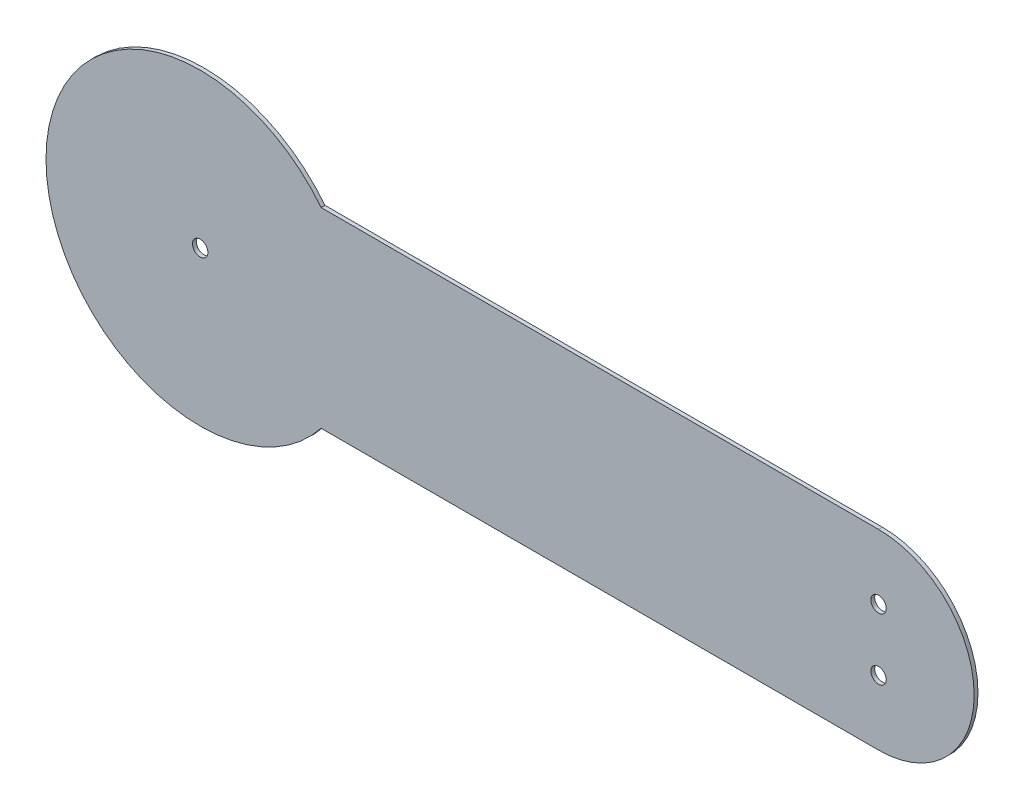
ISO-10303-21;
HEADER;
FILE_DESCRIPTION(('STEP AP214'),'2;1');
FILE_NAME('part.step','',(''),(''),'','','');
FILE_SCHEMA(('AUTOMOTIVE_DESIGN { 1 0 10303 214 1 1 1 1 }'));
ENDSEC;
DATA;
#1=APPLICATION_CONTEXT('core data for automotive mechanical design processes');
#2=APPLICATION_PROTOCOL_DEFINITION('international standard','automotive_design',2000,#1);
#3=PRODUCT_CONTEXT('',#1,'mechanical');
#4=PRODUCT('Part','Part','',(#3));
#5=PRODUCT_RELATED_PRODUCT_CATEGORY('part','',(#4));
#6=PRODUCT_DEFINITION_FORMATION('','',#4);
#7=PRODUCT_DEFINITION_CONTEXT('part definition',#1,'design');
#8=PRODUCT_DEFINITION('design','',#6,#7);
#9=PRODUCT_DEFINITION_SHAPE('','',#8);
#10=(LENGTH_UNIT() NAMED_UNIT(*) SI_UNIT(.MILLI.,.METRE.));
#11=(NAMED_UNIT(*) PLANE_ANGLE_UNIT() SI_UNIT($,.RADIAN.));
#12=(NAMED_UNIT(*) SI_UNIT($,.STERADIAN.) SOLID_ANGLE_UNIT());
#13=UNCERTAINTY_MEASURE_WITH_UNIT(LENGTH_MEASURE(1.E-05),#10,'distance_accuracy_value','');
#14=(GEOMETRIC_REPRESENTATION_CONTEXT(3) GLOBAL_UNCERTAINTY_ASSIGNED_CONTEXT((#13)) GLOBAL_UNIT_ASSIGNED_CONTEXT((#10,
#11,#12)) REPRESENTATION_CONTEXT('',''));
#15=CARTESIAN_POINT('',(0.,0.,0.));
#16=DIRECTION('',(0.,0.,1.));
#17=DIRECTION('',(1.,0.,0.));
#18=AXIS2_PLACEMENT_3D('',#15,#16,#17);
#19=CARTESIAN_POINT('',(279.4,0.,1.5875));
#20=DIRECTION('',(0.,0.,1.));
#21=DIRECTION('',(1.,0.,0.));
#22=AXIS2_PLACEMENT_3D('',#19,#20,#21);
#23=PLANE('',#22);
#24=CARTESIAN_POINT('',(279.4,12.7,1.5875));
#25=DIRECTION('',(0.,0.,1.));
#26=DIRECTION('',(1.,0.,0.));
#27=AXIS2_PLACEMENT_3D('',#24,#25,#26);
#28=CIRCLE('',#27,3.17499999999997);
#29=CARTESIAN_POINT('',(282.575,12.7,1.5875));
#30=VERTEX_POINT('',#29);
#31=EDGE_CURVE('E115',#30,#30,#28,.T.);
#32=ORIENTED_EDGE('',*,*,#31,.F.);
#33=EDGE_LOOP('',(#32));
#34=FACE_BOUND('',#33,.T.);
#35=CARTESIAN_POINT('',(279.4,0.,1.5875));
#36=DIRECTION('',(0.,0.,1.));
#37=DIRECTION('',(1.,0.,0.));
#38=AXIS2_PLACEMENT_3D('',#35,#36,#37);
#39=CIRCLE('',#38,39.37);
#40=CARTESIAN_POINT('',(279.4,-39.37,1.5875));
#41=VERTEX_POINT('',#40);
#42=CARTESIAN_POINT('',(279.4,39.37,1.5875));
#43=VERTEX_POINT('',#42);
#44=EDGE_CURVE('E85',#41,#43,#39,.T.);
#45=ORIENTED_EDGE('',*,*,#44,.T.);
#46=DIRECTION('',(-1.,0.,0.));
#47=VECTOR('',#46,1.);
#48=CARTESIAN_POINT('',(279.4,39.37,1.5875));
#49=LINE('',#48,#47);
#50=CARTESIAN_POINT('',(49.8222149246699,39.37,1.5875));
#51=VERTEX_POINT('',#50);
#52=EDGE_CURVE('E80',#43,#51,#49,.T.);
#53=ORIENTED_EDGE('',*,*,#52,.T.);
#54=CARTESIAN_POINT('',(0.,0.,1.5875));
#55=DIRECTION('',(0.,0.,1.));
#56=DIRECTION('',(1.,0.,0.));
#57=AXIS2_PLACEMENT_3D('',#54,#55,#56);
#58=CIRCLE('',#57,63.5);
#59=CARTESIAN_POINT('',(49.8222149246699,-39.37,1.5875));
#60=VERTEX_POINT('',#59);
#61=EDGE_CURVE('E83',#51,#60,#58,.T.);
#62=ORIENTED_EDGE('',*,*,#61,.T.);
#63=DIRECTION('',(1.,0.,0.));
#64=VECTOR('',#63,1.);
#65=CARTESIAN_POINT('',(279.4,-39.37,1.5875));
#66=LINE('',#65,#64);
#67=EDGE_CURVE('E50',#60,#41,#66,.T.);
#68=ORIENTED_EDGE('',*,*,#67,.T.);
#69=EDGE_LOOP('',(#45,#53,#62,#68));
#70=FACE_BOUND('',#69,.T.);
#71=CARTESIAN_POINT('',(0.,0.,1.5875));
#72=DIRECTION('',(0.,0.,1.));
#73=DIRECTION('',(1.,0.,0.));
#74=AXIS2_PLACEMENT_3D('',#71,#72,#73);
#75=CIRCLE('',#74,3.175);
#76=CARTESIAN_POINT('',(3.175,0.,1.5875));
#77=VERTEX_POINT('',#76);
#78=EDGE_CURVE('E100',#77,#77,#75,.T.);
#79=ORIENTED_EDGE('',*,*,#78,.F.);
#80=EDGE_LOOP('',(#79));
#81=FACE_BOUND('',#80,.T.);
#82=CARTESIAN_POINT('',(279.4,-12.7,1.5875));
#83=DIRECTION('',(0.,0.,1.));
#84=DIRECTION('',(1.,0.,0.));
#85=AXIS2_PLACEMENT_3D('',#82,#83,#84);
#86=CIRCLE('',#85,3.17499999999997);
#87=CARTESIAN_POINT('',(282.575,-12.7,1.5875));
#88=VERTEX_POINT('',#87);
#89=EDGE_CURVE('E121',#88,#88,#86,.T.);
#90=ORIENTED_EDGE('',*,*,#89,.F.);
#91=EDGE_LOOP('',(#90));
#92=FACE_BOUND('',#91,.T.);
#93=ADVANCED_FACE('F33',(#34,#70,#81,#92),#23,.T.);
#94=CARTESIAN_POINT('',(279.4,0.,0.));
#95=DIRECTION('',(0.,0.,1.));
#96=DIRECTION('',(1.,0.,0.));
#97=AXIS2_PLACEMENT_3D('',#94,#95,#96);
#98=PLANE('',#97);
#99=CARTESIAN_POINT('',(279.4,12.7,0.));
#100=DIRECTION('',(0.,0.,1.));
#101=DIRECTION('',(1.,0.,0.));
#102=AXIS2_PLACEMENT_3D('',#99,#100,#101);
#103=CIRCLE('',#102,3.17499999999997);
#104=CARTESIAN_POINT('',(282.575,12.7,0.));
#105=VERTEX_POINT('',#104);
#106=EDGE_CURVE('E118',#105,#105,#103,.T.);
#107=ORIENTED_EDGE('',*,*,#106,.T.);
#108=EDGE_LOOP('',(#107));
#109=FACE_BOUND('',#108,.T.);
#110=CARTESIAN_POINT('',(279.4,0.,0.));
#111=DIRECTION('',(0.,0.,1.));
#112=DIRECTION('',(1.,0.,0.));
#113=AXIS2_PLACEMENT_3D('',#110,#111,#112);
#114=CIRCLE('',#113,39.37);
#115=CARTESIAN_POINT('',(279.4,-39.37,0.));
#116=VERTEX_POINT('',#115);
#117=CARTESIAN_POINT('',(279.4,39.37,0.));
#118=VERTEX_POINT('',#117);
#119=EDGE_CURVE('E97',#116,#118,#114,.T.);
#120=ORIENTED_EDGE('',*,*,#119,.F.);
#121=DIRECTION('',(1.,0.,0.));
#122=VECTOR('',#121,1.);
#123=CARTESIAN_POINT('',(279.4,-39.37,0.));
#124=LINE('',#123,#122);
#125=CARTESIAN_POINT('',(49.8222149246699,-39.37,0.));
#126=VERTEX_POINT('',#125);
#127=EDGE_CURVE('E73',#126,#116,#124,.T.);
#128=ORIENTED_EDGE('',*,*,#127,.F.);
#129=CARTESIAN_POINT('',(0.,0.,0.));
#130=DIRECTION('',(0.,0.,1.));
#131=DIRECTION('',(1.,0.,0.));
#132=AXIS2_PLACEMENT_3D('',#129,#130,#131);
#133=CIRCLE('',#132,63.5);
#134=CARTESIAN_POINT('',(49.8222149246699,39.37,0.));
#135=VERTEX_POINT('',#134);
#136=EDGE_CURVE('E67',#135,#126,#133,.T.);
#137=ORIENTED_EDGE('',*,*,#136,.F.);
#138=DIRECTION('',(-1.,0.,0.));
#139=VECTOR('',#138,1.);
#140=CARTESIAN_POINT('',(279.4,39.37,0.));
#141=LINE('',#140,#139);
#142=EDGE_CURVE('E89',#118,#135,#141,.T.);
#143=ORIENTED_EDGE('',*,*,#142,.F.);
#144=EDGE_LOOP('',(#120,#128,#137,#143));
#145=FACE_BOUND('',#144,.T.);
#146=CARTESIAN_POINT('',(0.,0.,0.));
#147=DIRECTION('',(0.,0.,1.));
#148=DIRECTION('',(1.,0.,0.));
#149=AXIS2_PLACEMENT_3D('',#146,#147,#148);
#150=CIRCLE('',#149,3.175);
#151=CARTESIAN_POINT('',(3.175,0.,0.));
#152=VERTEX_POINT('',#151);
#153=EDGE_CURVE('E112',#152,#152,#150,.T.);
#154=ORIENTED_EDGE('',*,*,#153,.T.);
#155=EDGE_LOOP('',(#154));
#156=FACE_BOUND('',#155,.T.);
#157=CARTESIAN_POINT('',(279.4,-12.7,0.));
#158=DIRECTION('',(0.,0.,1.));
#159=DIRECTION('',(1.,0.,0.));
#160=AXIS2_PLACEMENT_3D('',#157,#158,#159);
#161=CIRCLE('',#160,3.17499999999997);
#162=CARTESIAN_POINT('',(282.575,-12.7,0.));
#163=VERTEX_POINT('',#162);
#164=EDGE_CURVE('E124',#163,#163,#161,.T.);
#165=ORIENTED_EDGE('',*,*,#164,.T.);
#166=EDGE_LOOP('',(#165));
#167=FACE_BOUND('',#166,.T.);
#168=ADVANCED_FACE('F108',(#109,#145,#156,#167),#98,.F.);
#169=CARTESIAN_POINT('',(279.4,0.,1.5875));
#170=DIRECTION('',(0.,0.,-1.));
#171=DIRECTION('',(-1.,0.,0.));
#172=AXIS2_PLACEMENT_3D('',#169,#170,#171);
#173=CYLINDRICAL_SURFACE('',#172,39.37);
#174=ORIENTED_EDGE('',*,*,#119,.T.);
#175=DIRECTION('',(0.,0.,-1.));
#176=VECTOR('',#175,1.);
#177=CARTESIAN_POINT('',(279.4,39.37,1.5875));
#178=LINE('',#177,#176);
#179=EDGE_CURVE('E11',#43,#118,#178,.T.);
#180=ORIENTED_EDGE('',*,*,#179,.F.);
#181=ORIENTED_EDGE('',*,*,#44,.F.);
#182=DIRECTION('',(0.,0.,-1.));
#183=VECTOR('',#182,1.);
#184=CARTESIAN_POINT('',(279.4,-39.37,1.5875));
#185=LINE('',#184,#183);
#186=EDGE_CURVE('E93',#41,#116,#185,.T.);
#187=ORIENTED_EDGE('',*,*,#186,.T.);
#188=EDGE_LOOP('',(#174,#180,#181,#187));
#189=FACE_BOUND('',#188,.T.);
#190=ADVANCED_FACE('F35',(#189),#173,.T.);
#191=CARTESIAN_POINT('',(279.4,39.37,1.5875));
#192=DIRECTION('',(0.,-1.,0.));
#193=DIRECTION('',(1.,0.,0.));
#194=AXIS2_PLACEMENT_3D('',#191,#192,#193);
#195=PLANE('',#194);
#196=ORIENTED_EDGE('',*,*,#142,.T.);
#197=DIRECTION('',(0.,0.,-1.));
#198=VECTOR('',#197,1.);
#199=CARTESIAN_POINT('',(49.8222149246699,39.37,1.5875));
#200=LINE('',#199,#198);
#201=EDGE_CURVE('E42',#51,#135,#200,.T.);
#202=ORIENTED_EDGE('',*,*,#201,.F.);
#203=ORIENTED_EDGE('',*,*,#52,.F.);
#204=ORIENTED_EDGE('',*,*,#179,.T.);
#205=EDGE_LOOP('',(#196,#202,#203,#204));
#206=FACE_BOUND('',#205,.T.);
#207=ADVANCED_FACE('F88',(#206),#195,.F.);
#208=CARTESIAN_POINT('',(0.,0.,1.5875));
#209=DIRECTION('',(0.,0.,-1.));
#210=DIRECTION('',(-1.,0.,0.));
#211=AXIS2_PLACEMENT_3D('',#208,#209,#210);
#212=CYLINDRICAL_SURFACE('',#211,63.5);
#213=ORIENTED_EDGE('',*,*,#136,.T.);
#214=DIRECTION('',(0.,0.,-1.));
#215=VECTOR('',#214,1.);
#216=CARTESIAN_POINT('',(49.8222149246699,-39.37,1.5875));
#217=LINE('',#216,#215);
#218=EDGE_CURVE('E90',#60,#126,#217,.T.);
#219=ORIENTED_EDGE('',*,*,#218,.F.);
#220=ORIENTED_EDGE('',*,*,#61,.F.);
#221=ORIENTED_EDGE('',*,*,#201,.T.);
#222=EDGE_LOOP('',(#213,#219,#220,#221));
#223=FACE_BOUND('',#222,.T.);
#224=ADVANCED_FACE('F91',(#223),#212,.T.);
#225=CARTESIAN_POINT('',(279.4,-39.37,1.5875));
#226=DIRECTION('',(0.,1.,0.));
#227=DIRECTION('',(-1.,0.,0.));
#228=AXIS2_PLACEMENT_3D('',#225,#226,#227);
#229=PLANE('',#228);
#230=ORIENTED_EDGE('',*,*,#127,.T.);
#231=ORIENTED_EDGE('',*,*,#186,.F.);
#232=ORIENTED_EDGE('',*,*,#67,.F.);
#233=ORIENTED_EDGE('',*,*,#218,.T.);
#234=EDGE_LOOP('',(#230,#231,#232,#233));
#235=FACE_BOUND('',#234,.T.);
#236=ADVANCED_FACE('F105',(#235),#229,.F.);
#237=CARTESIAN_POINT('',(0.,0.,1.5875));
#238=DIRECTION('',(0.,0.,-1.));
#239=DIRECTION('',(-1.,0.,0.));
#240=AXIS2_PLACEMENT_3D('',#237,#238,#239);
#241=CYLINDRICAL_SURFACE('',#240,3.175);
#242=ORIENTED_EDGE('',*,*,#78,.T.);
#243=EDGE_LOOP('',(#242));
#244=FACE_BOUND('',#243,.T.);
#245=ORIENTED_EDGE('',*,*,#153,.F.);
#246=EDGE_LOOP('',(#245));
#247=FACE_BOUND('',#246,.T.);
#248=ADVANCED_FACE('F143',(#244,#247),#241,.F.);
#249=CARTESIAN_POINT('',(279.4,12.7,1.5875));
#250=DIRECTION('',(0.,0.,-1.));
#251=DIRECTION('',(-1.,0.,0.));
#252=AXIS2_PLACEMENT_3D('',#249,#250,#251);
#253=CYLINDRICAL_SURFACE('',#252,3.17499999999997);
#254=ORIENTED_EDGE('',*,*,#31,.T.);
#255=EDGE_LOOP('',(#254));
#256=FACE_BOUND('',#255,.T.);
#257=ORIENTED_EDGE('',*,*,#106,.F.);
#258=EDGE_LOOP('',(#257));
#259=FACE_BOUND('',#258,.T.);
#260=ADVANCED_FACE('F189',(#256,#259),#253,.F.);
#261=CARTESIAN_POINT('',(279.4,-12.7,1.5875));
#262=DIRECTION('',(0.,0.,-1.));
#263=DIRECTION('',(-1.,0.,0.));
#264=AXIS2_PLACEMENT_3D('',#261,#262,#263);
#265=CYLINDRICAL_SURFACE('',#264,3.17499999999997);
#266=ORIENTED_EDGE('',*,*,#89,.T.);
#267=EDGE_LOOP('',(#266));
#268=FACE_BOUND('',#267,.T.);
#269=ORIENTED_EDGE('',*,*,#164,.F.);
#270=EDGE_LOOP('',(#269));
#271=FACE_BOUND('',#270,.T.);
#272=ADVANCED_FACE('F130',(#268,#271),#265,.F.);
#273=CLOSED_SHELL('',(#93,#168,#190,#207,#224,#236,#248,#260,#272));
#274=MANIFOLD_SOLID_BREP('B2',#273);
#275=ADVANCED_BREP_SHAPE_REPRESENTATION('',(#18,#274),#14);
#276=SHAPE_DEFINITION_REPRESENTATION(#9,#275);
ENDSEC;
END-ISO-10303-21;
